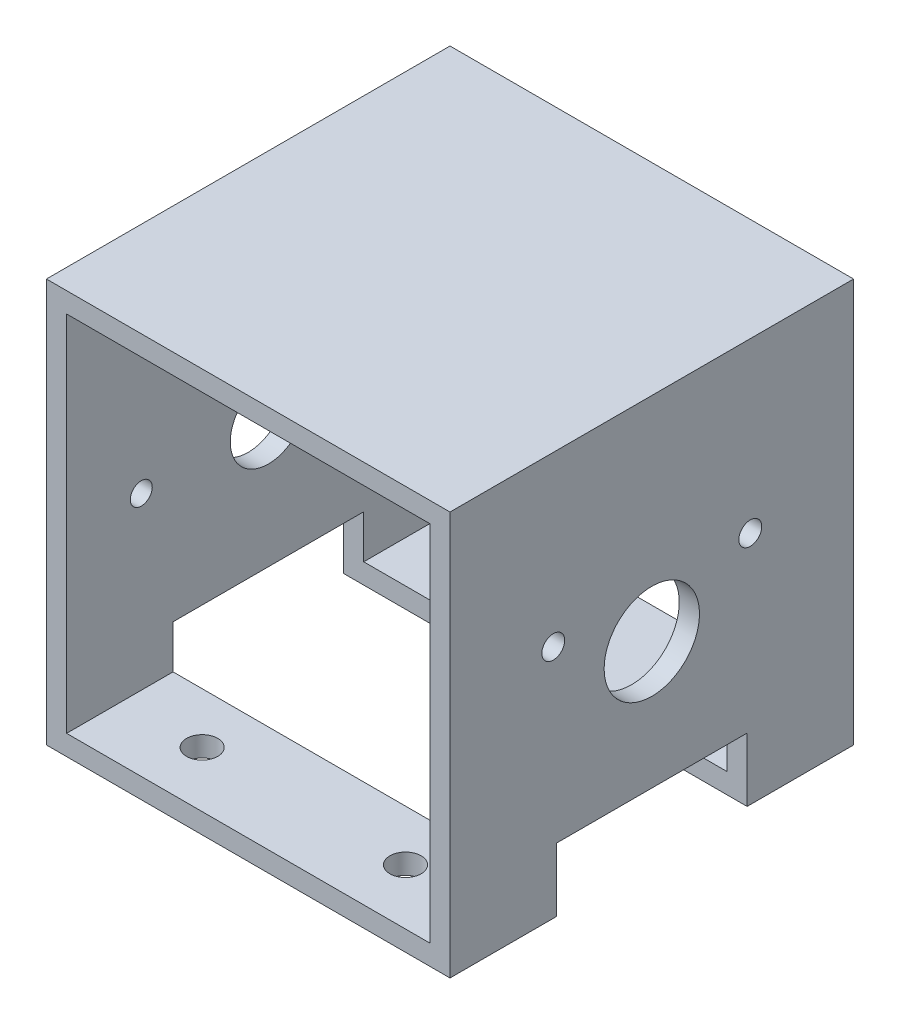
ISO-10303-21;
HEADER;
FILE_DESCRIPTION(('STEP AP214'),'2;1');
FILE_NAME('part.step','',(''),(''),'','','');
FILE_SCHEMA(('AUTOMOTIVE_DESIGN { 1 0 10303 214 1 1 1 1 }'));
ENDSEC;
DATA;
#1=APPLICATION_CONTEXT('core data for automotive mechanical design processes');
#2=APPLICATION_PROTOCOL_DEFINITION('international standard','automotive_design',2000,#1);
#3=PRODUCT_CONTEXT('',#1,'mechanical');
#4=PRODUCT('Part','Part','',(#3));
#5=PRODUCT_RELATED_PRODUCT_CATEGORY('part','',(#4));
#6=PRODUCT_DEFINITION_FORMATION('','',#4);
#7=PRODUCT_DEFINITION_CONTEXT('part definition',#1,'design');
#8=PRODUCT_DEFINITION('design','',#6,#7);
#9=PRODUCT_DEFINITION_SHAPE('','',#8);
#10=(LENGTH_UNIT() NAMED_UNIT(*) SI_UNIT(.MILLI.,.METRE.));
#11=(NAMED_UNIT(*) PLANE_ANGLE_UNIT() SI_UNIT($,.RADIAN.));
#12=(NAMED_UNIT(*) SI_UNIT($,.STERADIAN.) SOLID_ANGLE_UNIT());
#13=UNCERTAINTY_MEASURE_WITH_UNIT(LENGTH_MEASURE(1.E-05),#10,'distance_accuracy_value','');
#14=(GEOMETRIC_REPRESENTATION_CONTEXT(3) GLOBAL_UNCERTAINTY_ASSIGNED_CONTEXT((#13)) GLOBAL_UNIT_ASSIGNED_CONTEXT((#10,
#11,#12)) REPRESENTATION_CONTEXT('',''));
#15=CARTESIAN_POINT('',(0.,0.,0.));
#16=DIRECTION('',(0.,0.,1.));
#17=DIRECTION('',(1.,0.,0.));
#18=AXIS2_PLACEMENT_3D('',#15,#16,#17);
#19=CARTESIAN_POINT('',(-31.75,-31.75,63.5));
#20=DIRECTION('',(0.,1.,0.));
#21=DIRECTION('',(0.,0.,1.));
#22=AXIS2_PLACEMENT_3D('',#19,#20,#21);
#23=PLANE('',#22);
#24=CARTESIAN_POINT('',(-16.,-31.75,8.75000000000001));
#25=DIRECTION('',(0.,-1.,0.));
#26=DIRECTION('',(0.,0.,-1.));
#27=AXIS2_PLACEMENT_3D('',#24,#25,#26);
#28=CIRCLE('',#27,2.45745);
#29=CARTESIAN_POINT('',(-16.,-31.75,6.29255000000001));
#30=VERTEX_POINT('',#29);
#31=EDGE_CURVE('E464',#30,#30,#28,.T.);
#32=ORIENTED_EDGE('',*,*,#31,.F.);
#33=EDGE_LOOP('',(#32));
#34=FACE_BOUND('',#33,.T.);
#35=DIRECTION('',(0.,0.,-1.));
#36=VECTOR('',#35,1.);
#37=CARTESIAN_POINT('',(31.75,-31.75,63.5));
#38=LINE('',#37,#36);
#39=CARTESIAN_POINT('',(31.75,-31.75,16.75));
#40=VERTEX_POINT('',#39);
#41=CARTESIAN_POINT('',(31.75,-31.75,0.));
#42=VERTEX_POINT('',#41);
#43=EDGE_CURVE('E269',#40,#42,#38,.T.);
#44=ORIENTED_EDGE('',*,*,#43,.F.);
#45=DIRECTION('',(-1.,0.,0.));
#46=VECTOR('',#45,1.);
#47=CARTESIAN_POINT('',(-31.75,-31.75,16.75));
#48=LINE('',#47,#46);
#49=CARTESIAN_POINT('',(-31.75,-31.75,16.75));
#50=VERTEX_POINT('',#49);
#51=EDGE_CURVE('E220',#40,#50,#48,.T.);
#52=ORIENTED_EDGE('',*,*,#51,.T.);
#53=DIRECTION('',(0.,0.,-1.));
#54=VECTOR('',#53,1.);
#55=CARTESIAN_POINT('',(-31.75,-31.75,63.5));
#56=LINE('',#55,#54);
#57=CARTESIAN_POINT('',(-31.75,-31.75,0.));
#58=VERTEX_POINT('',#57);
#59=EDGE_CURVE('E196',#50,#58,#56,.T.);
#60=ORIENTED_EDGE('',*,*,#59,.T.);
#61=DIRECTION('',(1.,0.,0.));
#62=VECTOR('',#61,1.);
#63=CARTESIAN_POINT('',(-31.75,-31.75,0.));
#64=LINE('',#63,#62);
#65=EDGE_CURVE('E263',#58,#42,#64,.T.);
#66=ORIENTED_EDGE('',*,*,#65,.T.);
#67=EDGE_LOOP('',(#44,#52,#60,#66));
#68=FACE_BOUND('',#67,.T.);
#69=CARTESIAN_POINT('',(16.,-31.75,8.75000000000003));
#70=DIRECTION('',(0.,-1.,0.));
#71=DIRECTION('',(0.,0.,-1.));
#72=AXIS2_PLACEMENT_3D('',#69,#70,#71);
#73=CIRCLE('',#72,2.45745);
#74=CARTESIAN_POINT('',(16.,-31.75,6.29255000000003));
#75=VERTEX_POINT('',#74);
#76=EDGE_CURVE('E458',#75,#75,#73,.T.);
#77=ORIENTED_EDGE('',*,*,#76,.F.);
#78=EDGE_LOOP('',(#77));
#79=FACE_BOUND('',#78,.T.);
#80=ADVANCED_FACE('F58',(#34,#68,#79),#23,.F.);
#81=CARTESIAN_POINT('',(-31.75,-31.75,63.5));
#82=DIRECTION('',(1.,0.,0.));
#83=DIRECTION('',(0.,0.,-1.));
#84=AXIS2_PLACEMENT_3D('',#81,#82,#83);
#85=PLANE('',#84);
#86=CARTESIAN_POINT('',(-31.75,-1.75000000000001,31.75));
#87=DIRECTION('',(-1.,0.,0.));
#88=DIRECTION('',(0.,0.,1.));
#89=AXIS2_PLACEMENT_3D('',#86,#87,#88);
#90=CIRCLE('',#89,6.);
#91=CARTESIAN_POINT('',(-31.75,-1.75000000000001,37.75));
#92=VERTEX_POINT('',#91);
#93=EDGE_CURVE('E392',#92,#92,#90,.T.);
#94=ORIENTED_EDGE('',*,*,#93,.F.);
#95=EDGE_LOOP('',(#94));
#96=FACE_BOUND('',#95,.T.);
#97=CARTESIAN_POINT('',(-31.75,-1.75000000000001,11.75));
#98=DIRECTION('',(-1.,0.,0.));
#99=DIRECTION('',(0.,0.,1.));
#100=AXIS2_PLACEMENT_3D('',#97,#98,#99);
#101=CIRCLE('',#100,1.7272);
#102=CARTESIAN_POINT('',(-31.75,-1.75000000000001,13.4772));
#103=VERTEX_POINT('',#102);
#104=EDGE_CURVE('E403',#103,#103,#101,.T.);
#105=ORIENTED_EDGE('',*,*,#104,.F.);
#106=EDGE_LOOP('',(#105));
#107=FACE_BOUND('',#106,.T.);
#108=ORIENTED_EDGE('',*,*,#59,.F.);
#109=DIRECTION('',(0.,1.,0.));
#110=VECTOR('',#109,1.);
#111=CARTESIAN_POINT('',(-31.75,-41.75,16.75));
#112=LINE('',#111,#110);
#113=CARTESIAN_POINT('',(-31.75,-21.75,16.75));
#114=VERTEX_POINT('',#113);
#115=EDGE_CURVE('E174',#50,#114,#112,.T.);
#116=ORIENTED_EDGE('',*,*,#115,.T.);
#117=DIRECTION('',(0.,0.,1.));
#118=VECTOR('',#117,1.);
#119=CARTESIAN_POINT('',(-31.75,-21.75,16.75));
#120=LINE('',#119,#118);
#121=CARTESIAN_POINT('',(-31.75,-21.75,46.75));
#122=VERTEX_POINT('',#121);
#123=EDGE_CURVE('E185',#114,#122,#120,.T.);
#124=ORIENTED_EDGE('',*,*,#123,.T.);
#125=DIRECTION('',(0.,1.,0.));
#126=VECTOR('',#125,1.);
#127=CARTESIAN_POINT('',(-31.75,-41.75,46.75));
#128=LINE('',#127,#126);
#129=CARTESIAN_POINT('',(-31.75,-31.75,46.75));
#130=VERTEX_POINT('',#129);
#131=EDGE_CURVE('E190',#130,#122,#128,.T.);
#132=ORIENTED_EDGE('',*,*,#131,.F.);
#133=CARTESIAN_POINT('',(-31.75,-31.75,63.5));
#134=VERTEX_POINT('',#133);
#135=EDGE_CURVE('E281',#134,#130,#56,.T.);
#136=ORIENTED_EDGE('',*,*,#135,.F.);
#137=DIRECTION('',(0.,-1.,0.));
#138=VECTOR('',#137,1.);
#139=CARTESIAN_POINT('',(-31.75,-31.75,63.5));
#140=LINE('',#139,#138);
#141=CARTESIAN_POINT('',(-31.75,31.75,63.5));
#142=VERTEX_POINT('',#141);
#143=EDGE_CURVE('E265',#142,#134,#140,.T.);
#144=ORIENTED_EDGE('',*,*,#143,.F.);
#145=DIRECTION('',(0.,0.,-1.));
#146=VECTOR('',#145,1.);
#147=CARTESIAN_POINT('',(-31.75,31.75,63.5));
#148=LINE('',#147,#146);
#149=CARTESIAN_POINT('',(-31.75,31.75,0.));
#150=VERTEX_POINT('',#149);
#151=EDGE_CURVE('E284',#142,#150,#148,.T.);
#152=ORIENTED_EDGE('',*,*,#151,.T.);
#153=DIRECTION('',(0.,-1.,0.));
#154=VECTOR('',#153,1.);
#155=CARTESIAN_POINT('',(-31.75,-31.75,0.));
#156=LINE('',#155,#154);
#157=EDGE_CURVE('E274',#150,#58,#156,.T.);
#158=ORIENTED_EDGE('',*,*,#157,.T.);
#159=EDGE_LOOP('',(#108,#116,#124,#132,#136,#144,#152,#158));
#160=FACE_BOUND('',#159,.T.);
#161=CARTESIAN_POINT('',(-31.75,-1.75,51.75));
#162=DIRECTION('',(-1.,0.,0.));
#163=DIRECTION('',(0.,0.,1.));
#164=AXIS2_PLACEMENT_3D('',#161,#162,#163);
#165=CIRCLE('',#164,1.7272);
#166=CARTESIAN_POINT('',(-31.75,-1.75,53.4772));
#167=VERTEX_POINT('',#166);
#168=EDGE_CURVE('E395',#167,#167,#165,.T.);
#169=ORIENTED_EDGE('',*,*,#168,.F.);
#170=EDGE_LOOP('',(#169));
#171=FACE_BOUND('',#170,.T.);
#172=ADVANCED_FACE('F193',(#96,#107,#160,#171),#85,.F.);
#173=CARTESIAN_POINT('',(16.,-31.75,54.75));
#174=DIRECTION('',(0.,-1.,0.));
#175=DIRECTION('',(0.,0.,-1.));
#176=AXIS2_PLACEMENT_3D('',#173,#174,#175);
#177=CIRCLE('',#176,2.45745);
#178=CARTESIAN_POINT('',(16.,-31.75,52.29255));
#179=VERTEX_POINT('',#178);
#180=EDGE_CURVE('E377',#179,#179,#177,.T.);
#181=ORIENTED_EDGE('',*,*,#180,.F.);
#182=EDGE_LOOP('',(#181));
#183=FACE_BOUND('',#182,.T.);
#184=CARTESIAN_POINT('',(-16.,-31.75,54.75));
#185=DIRECTION('',(0.,-1.,0.));
#186=DIRECTION('',(0.,0.,-1.));
#187=AXIS2_PLACEMENT_3D('',#184,#185,#186);
#188=CIRCLE('',#187,2.45745);
#189=CARTESIAN_POINT('',(-16.,-31.75,52.29255));
#190=VERTEX_POINT('',#189);
#191=EDGE_CURVE('E380',#190,#190,#188,.T.);
#192=ORIENTED_EDGE('',*,*,#191,.F.);
#193=EDGE_LOOP('',(#192));
#194=FACE_BOUND('',#193,.T.);
#195=DIRECTION('',(-1.,0.,0.));
#196=VECTOR('',#195,1.);
#197=CARTESIAN_POINT('',(-31.75,-31.75,46.75));
#198=LINE('',#197,#196);
#199=CARTESIAN_POINT('',(31.75,-31.75,46.75));
#200=VERTEX_POINT('',#199);
#201=EDGE_CURVE('E215',#200,#130,#198,.T.);
#202=ORIENTED_EDGE('',*,*,#201,.F.);
#203=CARTESIAN_POINT('',(31.75,-31.75,63.5));
#204=VERTEX_POINT('',#203);
#205=EDGE_CURVE('E278',#204,#200,#38,.T.);
#206=ORIENTED_EDGE('',*,*,#205,.F.);
#207=DIRECTION('',(1.,0.,0.));
#208=VECTOR('',#207,1.);
#209=CARTESIAN_POINT('',(-31.75,-31.75,63.5));
#210=LINE('',#209,#208);
#211=EDGE_CURVE('E267',#134,#204,#210,.T.);
#212=ORIENTED_EDGE('',*,*,#211,.F.);
#213=ORIENTED_EDGE('',*,*,#135,.T.);
#214=EDGE_LOOP('',(#202,#206,#212,#213));
#215=FACE_BOUND('',#214,.T.);
#216=ADVANCED_FACE('F332',(#183,#194,#215),#23,.F.);
#217=CARTESIAN_POINT('',(0.,-28.575,63.5));
#218=DIRECTION('',(0.,1.,0.));
#219=DIRECTION('',(0.,0.,1.));
#220=AXIS2_PLACEMENT_3D('',#217,#218,#219);
#221=PLANE('',#220);
#222=CARTESIAN_POINT('',(16.,-28.575,54.75));
#223=DIRECTION('',(0.,1.,0.));
#224=DIRECTION('',(0.,0.,1.));
#225=AXIS2_PLACEMENT_3D('',#222,#223,#224);
#226=CIRCLE('',#225,2.45745);
#227=CARTESIAN_POINT('',(16.,-28.575,57.20745));
#228=VERTEX_POINT('',#227);
#229=EDGE_CURVE('E383',#228,#228,#226,.T.);
#230=ORIENTED_EDGE('',*,*,#229,.F.);
#231=EDGE_LOOP('',(#230));
#232=FACE_BOUND('',#231,.T.);
#233=CARTESIAN_POINT('',(-16.,-28.575,54.75));
#234=DIRECTION('',(0.,1.,0.));
#235=DIRECTION('',(0.,0.,1.));
#236=AXIS2_PLACEMENT_3D('',#233,#234,#235);
#237=CIRCLE('',#236,2.45745);
#238=CARTESIAN_POINT('',(-16.,-28.575,57.20745));
#239=VERTEX_POINT('',#238);
#240=EDGE_CURVE('E382',#239,#239,#237,.T.);
#241=ORIENTED_EDGE('',*,*,#240,.F.);
#242=EDGE_LOOP('',(#241));
#243=FACE_BOUND('',#242,.T.);
#244=DIRECTION('',(0.,0.,-1.));
#245=VECTOR('',#244,1.);
#246=CARTESIAN_POINT('',(28.575,-28.575,63.5));
#247=LINE('',#246,#245);
#248=CARTESIAN_POINT('',(28.575,-28.575,63.5));
#249=VERTEX_POINT('',#248);
#250=CARTESIAN_POINT('',(28.575,-28.575,46.75));
#251=VERTEX_POINT('',#250);
#252=EDGE_CURVE('E246',#249,#251,#247,.T.);
#253=ORIENTED_EDGE('',*,*,#252,.T.);
#254=DIRECTION('',(-1.,0.,0.));
#255=VECTOR('',#254,1.);
#256=CARTESIAN_POINT('',(0.,-28.575,46.75));
#257=LINE('',#256,#255);
#258=CARTESIAN_POINT('',(-28.575,-28.575,46.75));
#259=VERTEX_POINT('',#258);
#260=EDGE_CURVE('E290',#251,#259,#257,.T.);
#261=ORIENTED_EDGE('',*,*,#260,.T.);
#262=DIRECTION('',(0.,0.,-1.));
#263=VECTOR('',#262,1.);
#264=CARTESIAN_POINT('',(-28.575,-28.575,63.5));
#265=LINE('',#264,#263);
#266=CARTESIAN_POINT('',(-28.575,-28.575,63.5));
#267=VERTEX_POINT('',#266);
#268=EDGE_CURVE('E250',#267,#259,#265,.T.);
#269=ORIENTED_EDGE('',*,*,#268,.F.);
#270=DIRECTION('',(1.,0.,0.));
#271=VECTOR('',#270,1.);
#272=CARTESIAN_POINT('',(0.,-28.575,63.5));
#273=LINE('',#272,#271);
#274=EDGE_CURVE('E233',#267,#249,#273,.T.);
#275=ORIENTED_EDGE('',*,*,#274,.T.);
#276=EDGE_LOOP('',(#253,#261,#269,#275));
#277=FACE_BOUND('',#276,.T.);
#278=ADVANCED_FACE('F315',(#232,#243,#277),#221,.T.);
#279=CARTESIAN_POINT('',(0.,0.,63.5));
#280=DIRECTION('',(0.,0.,1.));
#281=DIRECTION('',(1.,0.,0.));
#282=AXIS2_PLACEMENT_3D('',#279,#280,#281);
#283=PLANE('',#282);
#284=DIRECTION('',(0.,1.,0.));
#285=VECTOR('',#284,1.);
#286=CARTESIAN_POINT('',(31.75,-31.75,63.5));
#287=LINE('',#286,#285);
#288=CARTESIAN_POINT('',(31.75,31.75,63.5));
#289=VERTEX_POINT('',#288);
#290=EDGE_CURVE('E259',#204,#289,#287,.T.);
#291=ORIENTED_EDGE('',*,*,#290,.T.);
#292=DIRECTION('',(-1.,0.,0.));
#293=VECTOR('',#292,1.);
#294=CARTESIAN_POINT('',(-31.75,31.75,63.5));
#295=LINE('',#294,#293);
#296=EDGE_CURVE('E262',#289,#142,#295,.T.);
#297=ORIENTED_EDGE('',*,*,#296,.T.);
#298=ORIENTED_EDGE('',*,*,#143,.T.);
#299=ORIENTED_EDGE('',*,*,#211,.T.);
#300=EDGE_LOOP('',(#291,#297,#298,#299));
#301=FACE_BOUND('',#300,.T.);
#302=DIRECTION('',(-1.,0.,0.));
#303=VECTOR('',#302,1.);
#304=CARTESIAN_POINT('',(0.,28.575,63.5));
#305=LINE('',#304,#303);
#306=CARTESIAN_POINT('',(28.575,28.575,63.5));
#307=VERTEX_POINT('',#306);
#308=CARTESIAN_POINT('',(-28.575,28.575,63.5));
#309=VERTEX_POINT('',#308);
#310=EDGE_CURVE('E227',#307,#309,#305,.T.);
#311=ORIENTED_EDGE('',*,*,#310,.F.);
#312=DIRECTION('',(0.,1.,0.));
#313=VECTOR('',#312,1.);
#314=CARTESIAN_POINT('',(28.575,0.,63.5));
#315=LINE('',#314,#313);
#316=EDGE_CURVE('E225',#249,#307,#315,.T.);
#317=ORIENTED_EDGE('',*,*,#316,.F.);
#318=ORIENTED_EDGE('',*,*,#274,.F.);
#319=DIRECTION('',(0.,-1.,0.));
#320=VECTOR('',#319,1.);
#321=CARTESIAN_POINT('',(-28.575,0.,63.5));
#322=LINE('',#321,#320);
#323=EDGE_CURVE('E230',#309,#267,#322,.T.);
#324=ORIENTED_EDGE('',*,*,#323,.F.);
#325=EDGE_LOOP('',(#311,#317,#318,#324));
#326=FACE_BOUND('',#325,.T.);
#327=ADVANCED_FACE('F311',(#301,#326),#283,.T.);
#328=CARTESIAN_POINT('',(0.,0.,0.));
#329=DIRECTION('',(0.,0.,1.));
#330=DIRECTION('',(1.,0.,0.));
#331=AXIS2_PLACEMENT_3D('',#328,#329,#330);
#332=PLANE('',#331);
#333=DIRECTION('',(0.,1.,0.));
#334=VECTOR('',#333,1.);
#335=CARTESIAN_POINT('',(31.75,-31.75,0.));
#336=LINE('',#335,#334);
#337=CARTESIAN_POINT('',(31.75,31.75,0.));
#338=VERTEX_POINT('',#337);
#339=EDGE_CURVE('E258',#42,#338,#336,.T.);
#340=ORIENTED_EDGE('',*,*,#339,.F.);
#341=ORIENTED_EDGE('',*,*,#65,.F.);
#342=ORIENTED_EDGE('',*,*,#157,.F.);
#343=DIRECTION('',(-1.,0.,0.));
#344=VECTOR('',#343,1.);
#345=CARTESIAN_POINT('',(-31.75,31.75,0.));
#346=LINE('',#345,#344);
#347=EDGE_CURVE('E272',#338,#150,#346,.T.);
#348=ORIENTED_EDGE('',*,*,#347,.F.);
#349=EDGE_LOOP('',(#340,#341,#342,#348));
#350=FACE_BOUND('',#349,.T.);
#351=DIRECTION('',(0.,1.,0.));
#352=VECTOR('',#351,1.);
#353=CARTESIAN_POINT('',(28.575,0.,0.));
#354=LINE('',#353,#352);
#355=CARTESIAN_POINT('',(28.575,-28.575,0.));
#356=VERTEX_POINT('',#355);
#357=CARTESIAN_POINT('',(28.575,28.575,0.));
#358=VERTEX_POINT('',#357);
#359=EDGE_CURVE('E224',#356,#358,#354,.T.);
#360=ORIENTED_EDGE('',*,*,#359,.T.);
#361=DIRECTION('',(-1.,0.,0.));
#362=VECTOR('',#361,1.);
#363=CARTESIAN_POINT('',(0.,28.575,0.));
#364=LINE('',#363,#362);
#365=CARTESIAN_POINT('',(-28.575,28.575,0.));
#366=VERTEX_POINT('',#365);
#367=EDGE_CURVE('E238',#358,#366,#364,.T.);
#368=ORIENTED_EDGE('',*,*,#367,.T.);
#369=DIRECTION('',(0.,-1.,0.));
#370=VECTOR('',#369,1.);
#371=CARTESIAN_POINT('',(-28.575,0.,0.));
#372=LINE('',#371,#370);
#373=CARTESIAN_POINT('',(-28.575,-28.575,0.));
#374=VERTEX_POINT('',#373);
#375=EDGE_CURVE('E241',#366,#374,#372,.T.);
#376=ORIENTED_EDGE('',*,*,#375,.T.);
#377=DIRECTION('',(1.,0.,0.));
#378=VECTOR('',#377,1.);
#379=CARTESIAN_POINT('',(0.,-28.575,0.));
#380=LINE('',#379,#378);
#381=EDGE_CURVE('E228',#374,#356,#380,.T.);
#382=ORIENTED_EDGE('',*,*,#381,.T.);
#383=EDGE_LOOP('',(#360,#368,#376,#382));
#384=FACE_BOUND('',#383,.T.);
#385=ADVANCED_FACE('F304',(#350,#384),#332,.F.);
#386=CARTESIAN_POINT('',(31.75,-31.75,63.5));
#387=DIRECTION('',(-1.,0.,0.));
#388=DIRECTION('',(0.,0.,1.));
#389=AXIS2_PLACEMENT_3D('',#386,#387,#388);
#390=PLANE('',#389);
#391=CARTESIAN_POINT('',(31.75,5.25,16.25));
#392=DIRECTION('',(-1.,0.,0.));
#393=DIRECTION('',(0.,0.,1.));
#394=AXIS2_PLACEMENT_3D('',#391,#392,#393);
#395=CIRCLE('',#394,1.8);
#396=CARTESIAN_POINT('',(31.75,5.25,18.05));
#397=VERTEX_POINT('',#396);
#398=EDGE_CURVE('E412',#397,#397,#395,.T.);
#399=ORIENTED_EDGE('',*,*,#398,.T.);
#400=EDGE_LOOP('',(#399));
#401=FACE_BOUND('',#400,.T.);
#402=CARTESIAN_POINT('',(31.75,5.25,47.25));
#403=DIRECTION('',(-1.,0.,0.));
#404=DIRECTION('',(0.,0.,1.));
#405=AXIS2_PLACEMENT_3D('',#402,#403,#404);
#406=CIRCLE('',#405,1.8);
#407=CARTESIAN_POINT('',(31.75,5.25,49.05));
#408=VERTEX_POINT('',#407);
#409=EDGE_CURVE('E418',#408,#408,#406,.T.);
#410=ORIENTED_EDGE('',*,*,#409,.T.);
#411=EDGE_LOOP('',(#410));
#412=FACE_BOUND('',#411,.T.);
#413=CARTESIAN_POINT('',(31.75,-1.75000000000001,31.75));
#414=DIRECTION('',(-1.,0.,0.));
#415=DIRECTION('',(0.,0.,1.));
#416=AXIS2_PLACEMENT_3D('',#413,#414,#415);
#417=CIRCLE('',#416,7.5);
#418=CARTESIAN_POINT('',(31.75,-1.75000000000001,39.25));
#419=VERTEX_POINT('',#418);
#420=EDGE_CURVE('E207',#419,#419,#417,.T.);
#421=ORIENTED_EDGE('',*,*,#420,.T.);
#422=EDGE_LOOP('',(#421));
#423=FACE_BOUND('',#422,.T.);
#424=DIRECTION('',(0.,0.,1.));
#425=VECTOR('',#424,1.);
#426=CARTESIAN_POINT('',(31.75,-21.75,16.75));
#427=LINE('',#426,#425);
#428=CARTESIAN_POINT('',(31.75,-21.75,16.75));
#429=VERTEX_POINT('',#428);
#430=CARTESIAN_POINT('',(31.75,-21.75,46.75));
#431=VERTEX_POINT('',#430);
#432=EDGE_CURVE('E198',#429,#431,#427,.T.);
#433=ORIENTED_EDGE('',*,*,#432,.F.);
#434=DIRECTION('',(0.,1.,0.));
#435=VECTOR('',#434,1.);
#436=CARTESIAN_POINT('',(31.75,-41.75,16.75));
#437=LINE('',#436,#435);
#438=EDGE_CURVE('E205',#40,#429,#437,.T.);
#439=ORIENTED_EDGE('',*,*,#438,.F.);
#440=ORIENTED_EDGE('',*,*,#43,.T.);
#441=ORIENTED_EDGE('',*,*,#339,.T.);
#442=DIRECTION('',(0.,0.,-1.));
#443=VECTOR('',#442,1.);
#444=CARTESIAN_POINT('',(31.75,31.75,63.5));
#445=LINE('',#444,#443);
#446=EDGE_CURVE('E287',#289,#338,#445,.T.);
#447=ORIENTED_EDGE('',*,*,#446,.F.);
#448=ORIENTED_EDGE('',*,*,#290,.F.);
#449=ORIENTED_EDGE('',*,*,#205,.T.);
#450=DIRECTION('',(0.,1.,0.));
#451=VECTOR('',#450,1.);
#452=CARTESIAN_POINT('',(31.75,-41.75,46.75));
#453=LINE('',#452,#451);
#454=EDGE_CURVE('E73',#200,#431,#453,.T.);
#455=ORIENTED_EDGE('',*,*,#454,.T.);
#456=EDGE_LOOP('',(#433,#439,#440,#441,#447,#448,#449,#455));
#457=FACE_BOUND('',#456,.T.);
#458=ADVANCED_FACE('F60',(#401,#412,#423,#457),#390,.F.);
#459=CARTESIAN_POINT('',(-31.75,31.75,63.5));
#460=DIRECTION('',(0.,-1.,0.));
#461=DIRECTION('',(0.,0.,-1.));
#462=AXIS2_PLACEMENT_3D('',#459,#460,#461);
#463=PLANE('',#462);
#464=ORIENTED_EDGE('',*,*,#347,.T.);
#465=ORIENTED_EDGE('',*,*,#151,.F.);
#466=ORIENTED_EDGE('',*,*,#296,.F.);
#467=ORIENTED_EDGE('',*,*,#446,.T.);
#468=EDGE_LOOP('',(#464,#465,#466,#467));
#469=FACE_BOUND('',#468,.T.);
#470=ADVANCED_FACE('F339',(#469),#463,.F.);
#471=CARTESIAN_POINT('',(28.575,0.,63.5));
#472=DIRECTION('',(-1.,0.,0.));
#473=DIRECTION('',(0.,0.,1.));
#474=AXIS2_PLACEMENT_3D('',#471,#472,#473);
#475=PLANE('',#474);
#476=CARTESIAN_POINT('',(28.575,5.25,16.25));
#477=DIRECTION('',(-1.,0.,0.));
#478=DIRECTION('',(0.,0.,1.));
#479=AXIS2_PLACEMENT_3D('',#476,#477,#478);
#480=CIRCLE('',#479,1.8);
#481=CARTESIAN_POINT('',(28.575,5.25,18.05));
#482=VERTEX_POINT('',#481);
#483=EDGE_CURVE('E409',#482,#482,#480,.T.);
#484=ORIENTED_EDGE('',*,*,#483,.F.);
#485=EDGE_LOOP('',(#484));
#486=FACE_BOUND('',#485,.T.);
#487=CARTESIAN_POINT('',(28.575,5.25,47.25));
#488=DIRECTION('',(-1.,0.,0.));
#489=DIRECTION('',(0.,0.,1.));
#490=AXIS2_PLACEMENT_3D('',#487,#488,#489);
#491=CIRCLE('',#490,1.8);
#492=CARTESIAN_POINT('',(28.575,5.25,49.05));
#493=VERTEX_POINT('',#492);
#494=EDGE_CURVE('E415',#493,#493,#491,.T.);
#495=ORIENTED_EDGE('',*,*,#494,.F.);
#496=EDGE_LOOP('',(#495));
#497=FACE_BOUND('',#496,.T.);
#498=CARTESIAN_POINT('',(28.575,-1.75000000000001,31.75));
#499=DIRECTION('',(-1.,0.,0.));
#500=DIRECTION('',(0.,0.,1.));
#501=AXIS2_PLACEMENT_3D('',#498,#499,#500);
#502=CIRCLE('',#501,7.5);
#503=CARTESIAN_POINT('',(28.575,-1.75000000000001,39.25));
#504=VERTEX_POINT('',#503);
#505=EDGE_CURVE('E201',#504,#504,#502,.T.);
#506=ORIENTED_EDGE('',*,*,#505,.F.);
#507=EDGE_LOOP('',(#506));
#508=FACE_BOUND('',#507,.T.);
#509=DIRECTION('',(0.,-1.,0.));
#510=VECTOR('',#509,1.);
#511=CARTESIAN_POINT('',(28.575,0.,16.75));
#512=LINE('',#511,#510);
#513=CARTESIAN_POINT('',(28.575,-21.75,16.75));
#514=VERTEX_POINT('',#513);
#515=CARTESIAN_POINT('',(28.575,-28.575,16.75));
#516=VERTEX_POINT('',#515);
#517=EDGE_CURVE('E218',#514,#516,#512,.T.);
#518=ORIENTED_EDGE('',*,*,#517,.F.);
#519=DIRECTION('',(0.,0.,-1.));
#520=VECTOR('',#519,1.);
#521=CARTESIAN_POINT('',(28.575,-21.75,63.5));
#522=LINE('',#521,#520);
#523=CARTESIAN_POINT('',(28.575,-21.75,46.75));
#524=VERTEX_POINT('',#523);
#525=EDGE_CURVE('E222',#524,#514,#522,.T.);
#526=ORIENTED_EDGE('',*,*,#525,.F.);
#527=DIRECTION('',(0.,-1.,0.));
#528=VECTOR('',#527,1.);
#529=CARTESIAN_POINT('',(28.575,0.,46.75));
#530=LINE('',#529,#528);
#531=EDGE_CURVE('E212',#524,#251,#530,.T.);
#532=ORIENTED_EDGE('',*,*,#531,.T.);
#533=ORIENTED_EDGE('',*,*,#252,.F.);
#534=ORIENTED_EDGE('',*,*,#316,.T.);
#535=DIRECTION('',(0.,0.,-1.));
#536=VECTOR('',#535,1.);
#537=CARTESIAN_POINT('',(28.575,28.575,63.5));
#538=LINE('',#537,#536);
#539=EDGE_CURVE('E255',#307,#358,#538,.T.);
#540=ORIENTED_EDGE('',*,*,#539,.T.);
#541=ORIENTED_EDGE('',*,*,#359,.F.);
#542=EDGE_CURVE('E235',#516,#356,#247,.T.);
#543=ORIENTED_EDGE('',*,*,#542,.F.);
#544=EDGE_LOOP('',(#518,#526,#532,#533,#534,#540,#541,#543));
#545=FACE_BOUND('',#544,.T.);
#546=ADVANCED_FACE('F317',(#486,#497,#508,#545),#475,.T.);
#547=CARTESIAN_POINT('',(0.,28.575,63.5));
#548=DIRECTION('',(0.,-1.,0.));
#549=DIRECTION('',(0.,0.,-1.));
#550=AXIS2_PLACEMENT_3D('',#547,#548,#549);
#551=PLANE('',#550);
#552=ORIENTED_EDGE('',*,*,#367,.F.);
#553=ORIENTED_EDGE('',*,*,#539,.F.);
#554=ORIENTED_EDGE('',*,*,#310,.T.);
#555=DIRECTION('',(0.,0.,-1.));
#556=VECTOR('',#555,1.);
#557=CARTESIAN_POINT('',(-28.575,28.575,63.5));
#558=LINE('',#557,#556);
#559=EDGE_CURVE('E253',#309,#366,#558,.T.);
#560=ORIENTED_EDGE('',*,*,#559,.T.);
#561=EDGE_LOOP('',(#552,#553,#554,#560));
#562=FACE_BOUND('',#561,.T.);
#563=ADVANCED_FACE('F346',(#562),#551,.T.);
#564=CARTESIAN_POINT('',(-28.575,0.,63.5));
#565=DIRECTION('',(1.,0.,0.));
#566=DIRECTION('',(0.,0.,-1.));
#567=AXIS2_PLACEMENT_3D('',#564,#565,#566);
#568=PLANE('',#567);
#569=CARTESIAN_POINT('',(-28.575,-1.75000000000001,31.75));
#570=DIRECTION('',(1.,0.,0.));
#571=DIRECTION('',(0.,0.,-1.));
#572=AXIS2_PLACEMENT_3D('',#569,#570,#571);
#573=CIRCLE('',#572,6.);
#574=CARTESIAN_POINT('',(-28.575,-1.75000000000001,25.75));
#575=VERTEX_POINT('',#574);
#576=EDGE_CURVE('E386',#575,#575,#573,.F.);
#577=ORIENTED_EDGE('',*,*,#576,.T.);
#578=EDGE_LOOP('',(#577));
#579=FACE_BOUND('',#578,.T.);
#580=CARTESIAN_POINT('',(-28.575,-1.75,51.75));
#581=DIRECTION('',(1.,0.,0.));
#582=DIRECTION('',(0.,0.,-1.));
#583=AXIS2_PLACEMENT_3D('',#580,#581,#582);
#584=CIRCLE('',#583,1.7272);
#585=CARTESIAN_POINT('',(-28.575,-1.75,50.0228));
#586=VERTEX_POINT('',#585);
#587=EDGE_CURVE('E400',#586,#586,#584,.T.);
#588=ORIENTED_EDGE('',*,*,#587,.F.);
#589=EDGE_LOOP('',(#588));
#590=FACE_BOUND('',#589,.T.);
#591=CARTESIAN_POINT('',(-28.575,-1.75000000000001,11.75));
#592=DIRECTION('',(1.,0.,0.));
#593=DIRECTION('',(0.,0.,-1.));
#594=AXIS2_PLACEMENT_3D('',#591,#592,#593);
#595=CIRCLE('',#594,1.7272);
#596=CARTESIAN_POINT('',(-28.575,-1.75000000000001,10.0228));
#597=VERTEX_POINT('',#596);
#598=EDGE_CURVE('E406',#597,#597,#595,.T.);
#599=ORIENTED_EDGE('',*,*,#598,.F.);
#600=EDGE_LOOP('',(#599));
#601=FACE_BOUND('',#600,.T.);
#602=DIRECTION('',(0.,1.,0.));
#603=VECTOR('',#602,1.);
#604=CARTESIAN_POINT('',(-28.575,0.,16.75));
#605=LINE('',#604,#603);
#606=CARTESIAN_POINT('',(-28.575,-28.575,16.75));
#607=VERTEX_POINT('',#606);
#608=CARTESIAN_POINT('',(-28.575,-21.75,16.75));
#609=VERTEX_POINT('',#608);
#610=EDGE_CURVE('E177',#607,#609,#605,.T.);
#611=ORIENTED_EDGE('',*,*,#610,.F.);
#612=EDGE_CURVE('E249',#607,#374,#265,.T.);
#613=ORIENTED_EDGE('',*,*,#612,.T.);
#614=ORIENTED_EDGE('',*,*,#375,.F.);
#615=ORIENTED_EDGE('',*,*,#559,.F.);
#616=ORIENTED_EDGE('',*,*,#323,.T.);
#617=ORIENTED_EDGE('',*,*,#268,.T.);
#618=DIRECTION('',(0.,1.,0.));
#619=VECTOR('',#618,1.);
#620=CARTESIAN_POINT('',(-28.575,0.,46.75));
#621=LINE('',#620,#619);
#622=CARTESIAN_POINT('',(-28.575,-21.75,46.75));
#623=VERTEX_POINT('',#622);
#624=EDGE_CURVE('E80',#259,#623,#621,.T.);
#625=ORIENTED_EDGE('',*,*,#624,.T.);
#626=DIRECTION('',(0.,0.,1.));
#627=VECTOR('',#626,1.);
#628=CARTESIAN_POINT('',(-28.575,-21.75,63.5));
#629=LINE('',#628,#627);
#630=EDGE_CURVE('E12',#609,#623,#629,.T.);
#631=ORIENTED_EDGE('',*,*,#630,.F.);
#632=EDGE_LOOP('',(#611,#613,#614,#615,#616,#617,#625,#631));
#633=FACE_BOUND('',#632,.T.);
#634=ADVANCED_FACE('F298',(#579,#590,#601,#633),#568,.T.);
#635=CARTESIAN_POINT('',(-16.,-28.575,8.75000000000001));
#636=DIRECTION('',(0.,1.,0.));
#637=DIRECTION('',(0.,0.,1.));
#638=AXIS2_PLACEMENT_3D('',#635,#636,#637);
#639=CIRCLE('',#638,2.45745);
#640=CARTESIAN_POINT('',(-16.,-28.575,11.20745));
#641=VERTEX_POINT('',#640);
#642=EDGE_CURVE('E453',#641,#641,#639,.T.);
#643=ORIENTED_EDGE('',*,*,#642,.F.);
#644=EDGE_LOOP('',(#643));
#645=FACE_BOUND('',#644,.T.);
#646=CARTESIAN_POINT('',(16.,-28.575,8.75000000000003));
#647=DIRECTION('',(0.,1.,0.));
#648=DIRECTION('',(0.,0.,1.));
#649=AXIS2_PLACEMENT_3D('',#646,#647,#648);
#650=CIRCLE('',#649,2.45745);
#651=CARTESIAN_POINT('',(16.,-28.575,11.20745));
#652=VERTEX_POINT('',#651);
#653=EDGE_CURVE('E456',#652,#652,#650,.T.);
#654=ORIENTED_EDGE('',*,*,#653,.F.);
#655=EDGE_LOOP('',(#654));
#656=FACE_BOUND('',#655,.T.);
#657=DIRECTION('',(-1.,0.,0.));
#658=VECTOR('',#657,1.);
#659=CARTESIAN_POINT('',(0.,-28.575,16.75));
#660=LINE('',#659,#658);
#661=EDGE_CURVE('E66',#516,#607,#660,.T.);
#662=ORIENTED_EDGE('',*,*,#661,.F.);
#663=ORIENTED_EDGE('',*,*,#542,.T.);
#664=ORIENTED_EDGE('',*,*,#381,.F.);
#665=ORIENTED_EDGE('',*,*,#612,.F.);
#666=EDGE_LOOP('',(#662,#663,#664,#665));
#667=FACE_BOUND('',#666,.T.);
#668=ADVANCED_FACE('F301',(#645,#656,#667),#221,.T.);
#669=CARTESIAN_POINT('',(-31.75,-21.75,16.75));
#670=DIRECTION('',(0.,1.,0.));
#671=DIRECTION('',(0.,0.,1.));
#672=AXIS2_PLACEMENT_3D('',#669,#670,#671);
#673=PLANE('',#672);
#674=ORIENTED_EDGE('',*,*,#525,.T.);
#675=DIRECTION('',(1.,0.,0.));
#676=VECTOR('',#675,1.);
#677=CARTESIAN_POINT('',(-31.75,-21.75,16.75));
#678=LINE('',#677,#676);
#679=EDGE_CURVE('E181',#514,#429,#678,.T.);
#680=ORIENTED_EDGE('',*,*,#679,.T.);
#681=ORIENTED_EDGE('',*,*,#432,.T.);
#682=DIRECTION('',(1.,0.,0.));
#683=VECTOR('',#682,1.);
#684=CARTESIAN_POINT('',(-31.75,-21.75,46.75));
#685=LINE('',#684,#683);
#686=EDGE_CURVE('E180',#524,#431,#685,.T.);
#687=ORIENTED_EDGE('',*,*,#686,.F.);
#688=EDGE_LOOP('',(#674,#680,#681,#687));
#689=FACE_BOUND('',#688,.T.);
#690=ADVANCED_FACE('F323',(#689),#673,.F.);
#691=CARTESIAN_POINT('',(-31.75,-41.75,16.75));
#692=DIRECTION('',(0.,0.,-1.));
#693=DIRECTION('',(-1.,0.,0.));
#694=AXIS2_PLACEMENT_3D('',#691,#692,#693);
#695=PLANE('',#694);
#696=ORIENTED_EDGE('',*,*,#438,.T.);
#697=ORIENTED_EDGE('',*,*,#679,.F.);
#698=ORIENTED_EDGE('',*,*,#517,.T.);
#699=ORIENTED_EDGE('',*,*,#661,.T.);
#700=ORIENTED_EDGE('',*,*,#610,.T.);
#701=EDGE_CURVE('E169',#114,#609,#678,.T.);
#702=ORIENTED_EDGE('',*,*,#701,.F.);
#703=ORIENTED_EDGE('',*,*,#115,.F.);
#704=ORIENTED_EDGE('',*,*,#51,.F.);
#705=EDGE_LOOP('',(#696,#697,#698,#699,#700,#702,#703,#704));
#706=FACE_BOUND('',#705,.T.);
#707=ADVANCED_FACE('F172',(#706),#695,.F.);
#708=CARTESIAN_POINT('',(-31.75,-41.75,46.75));
#709=DIRECTION('',(0.,0.,-1.));
#710=DIRECTION('',(-1.,0.,0.));
#711=AXIS2_PLACEMENT_3D('',#708,#709,#710);
#712=PLANE('',#711);
#713=ORIENTED_EDGE('',*,*,#201,.T.);
#714=ORIENTED_EDGE('',*,*,#131,.T.);
#715=EDGE_CURVE('E187',#122,#623,#685,.T.);
#716=ORIENTED_EDGE('',*,*,#715,.T.);
#717=ORIENTED_EDGE('',*,*,#624,.F.);
#718=ORIENTED_EDGE('',*,*,#260,.F.);
#719=ORIENTED_EDGE('',*,*,#531,.F.);
#720=ORIENTED_EDGE('',*,*,#686,.T.);
#721=ORIENTED_EDGE('',*,*,#454,.F.);
#722=EDGE_LOOP('',(#713,#714,#716,#717,#718,#719,#720,#721));
#723=FACE_BOUND('',#722,.T.);
#724=ADVANCED_FACE('F321',(#723),#712,.T.);
#725=ORIENTED_EDGE('',*,*,#630,.T.);
#726=ORIENTED_EDGE('',*,*,#715,.F.);
#727=ORIENTED_EDGE('',*,*,#123,.F.);
#728=ORIENTED_EDGE('',*,*,#701,.T.);
#729=EDGE_LOOP('',(#725,#726,#727,#728));
#730=FACE_BOUND('',#729,.T.);
#731=ADVANCED_FACE('F186',(#730),#673,.F.);
#732=CARTESIAN_POINT('',(31.75,-1.75000000000001,31.75));
#733=DIRECTION('',(-1.,0.,0.));
#734=DIRECTION('',(0.,0.,1.));
#735=AXIS2_PLACEMENT_3D('',#732,#733,#734);
#736=CYLINDRICAL_SURFACE('',#735,7.5);
#737=ORIENTED_EDGE('',*,*,#420,.F.);
#738=EDGE_LOOP('',(#737));
#739=FACE_BOUND('',#738,.T.);
#740=ORIENTED_EDGE('',*,*,#505,.T.);
#741=EDGE_LOOP('',(#740));
#742=FACE_BOUND('',#741,.T.);
#743=ADVANCED_FACE('F426',(#739,#742),#736,.F.);
#744=CARTESIAN_POINT('',(28.575,5.25,47.25));
#745=DIRECTION('',(-1.,0.,0.));
#746=DIRECTION('',(0.,0.,1.));
#747=AXIS2_PLACEMENT_3D('',#744,#745,#746);
#748=CYLINDRICAL_SURFACE('',#747,1.8);
#749=ORIENTED_EDGE('',*,*,#409,.F.);
#750=EDGE_LOOP('',(#749));
#751=FACE_BOUND('',#750,.T.);
#752=ORIENTED_EDGE('',*,*,#494,.T.);
#753=EDGE_LOOP('',(#752));
#754=FACE_BOUND('',#753,.T.);
#755=ADVANCED_FACE('F429',(#751,#754),#748,.F.);
#756=CARTESIAN_POINT('',(28.575,5.25,16.25));
#757=DIRECTION('',(-1.,0.,0.));
#758=DIRECTION('',(0.,0.,1.));
#759=AXIS2_PLACEMENT_3D('',#756,#757,#758);
#760=CYLINDRICAL_SURFACE('',#759,1.8);
#761=ORIENTED_EDGE('',*,*,#398,.F.);
#762=EDGE_LOOP('',(#761));
#763=FACE_BOUND('',#762,.T.);
#764=ORIENTED_EDGE('',*,*,#483,.T.);
#765=EDGE_LOOP('',(#764));
#766=FACE_BOUND('',#765,.T.);
#767=ADVANCED_FACE('F436',(#763,#766),#760,.F.);
#768=CARTESIAN_POINT('',(-31.75,-1.75000000000001,11.75));
#769=DIRECTION('',(-1.,0.,0.));
#770=DIRECTION('',(0.,0.,1.));
#771=AXIS2_PLACEMENT_3D('',#768,#769,#770);
#772=CYLINDRICAL_SURFACE('',#771,1.7272);
#773=ORIENTED_EDGE('',*,*,#104,.T.);
#774=EDGE_LOOP('',(#773));
#775=FACE_BOUND('',#774,.T.);
#776=ORIENTED_EDGE('',*,*,#598,.T.);
#777=EDGE_LOOP('',(#776));
#778=FACE_BOUND('',#777,.T.);
#779=ADVANCED_FACE('F492',(#775,#778),#772,.F.);
#780=CARTESIAN_POINT('',(-31.75,-1.75,51.75));
#781=DIRECTION('',(-1.,0.,0.));
#782=DIRECTION('',(0.,0.,1.));
#783=AXIS2_PLACEMENT_3D('',#780,#781,#782);
#784=CYLINDRICAL_SURFACE('',#783,1.7272);
#785=ORIENTED_EDGE('',*,*,#168,.T.);
#786=EDGE_LOOP('',(#785));
#787=FACE_BOUND('',#786,.T.);
#788=ORIENTED_EDGE('',*,*,#587,.T.);
#789=EDGE_LOOP('',(#788));
#790=FACE_BOUND('',#789,.T.);
#791=ADVANCED_FACE('F488',(#787,#790),#784,.F.);
#792=CARTESIAN_POINT('',(31.751,-1.75000000000001,31.75));
#793=DIRECTION('',(-1.,0.,0.));
#794=DIRECTION('',(0.,0.,1.));
#795=AXIS2_PLACEMENT_3D('',#792,#793,#794);
#796=CYLINDRICAL_SURFACE('',#795,6.);
#797=ORIENTED_EDGE('',*,*,#576,.F.);
#798=EDGE_LOOP('',(#797));
#799=FACE_BOUND('',#798,.T.);
#800=ORIENTED_EDGE('',*,*,#93,.T.);
#801=EDGE_LOOP('',(#800));
#802=FACE_BOUND('',#801,.T.);
#803=ADVANCED_FACE('F485',(#799,#802),#796,.F.);
#804=CARTESIAN_POINT('',(-16.,-31.75,54.75));
#805=DIRECTION('',(0.,-1.,0.));
#806=DIRECTION('',(0.,0.,-1.));
#807=AXIS2_PLACEMENT_3D('',#804,#805,#806);
#808=CYLINDRICAL_SURFACE('',#807,2.45745);
#809=ORIENTED_EDGE('',*,*,#191,.T.);
#810=EDGE_LOOP('',(#809));
#811=FACE_BOUND('',#810,.T.);
#812=ORIENTED_EDGE('',*,*,#240,.T.);
#813=EDGE_LOOP('',(#812));
#814=FACE_BOUND('',#813,.T.);
#815=ADVANCED_FACE('F481',(#811,#814),#808,.F.);
#816=CARTESIAN_POINT('',(16.,-31.75,54.75));
#817=DIRECTION('',(0.,-1.,0.));
#818=DIRECTION('',(0.,0.,-1.));
#819=AXIS2_PLACEMENT_3D('',#816,#817,#818);
#820=CYLINDRICAL_SURFACE('',#819,2.45745);
#821=ORIENTED_EDGE('',*,*,#180,.T.);
#822=EDGE_LOOP('',(#821));
#823=FACE_BOUND('',#822,.T.);
#824=ORIENTED_EDGE('',*,*,#229,.T.);
#825=EDGE_LOOP('',(#824));
#826=FACE_BOUND('',#825,.T.);
#827=ADVANCED_FACE('F475',(#823,#826),#820,.F.);
#828=CARTESIAN_POINT('',(16.,-31.75,8.75000000000003));
#829=DIRECTION('',(0.,-1.,0.));
#830=DIRECTION('',(0.,0.,-1.));
#831=AXIS2_PLACEMENT_3D('',#828,#829,#830);
#832=CYLINDRICAL_SURFACE('',#831,2.45745);
#833=ORIENTED_EDGE('',*,*,#76,.T.);
#834=EDGE_LOOP('',(#833));
#835=FACE_BOUND('',#834,.T.);
#836=ORIENTED_EDGE('',*,*,#653,.T.);
#837=EDGE_LOOP('',(#836));
#838=FACE_BOUND('',#837,.T.);
#839=ADVANCED_FACE('F470',(#835,#838),#832,.F.);
#840=CARTESIAN_POINT('',(-16.,-31.75,8.75000000000001));
#841=DIRECTION('',(0.,-1.,0.));
#842=DIRECTION('',(0.,0.,-1.));
#843=AXIS2_PLACEMENT_3D('',#840,#841,#842);
#844=CYLINDRICAL_SURFACE('',#843,2.45745);
#845=ORIENTED_EDGE('',*,*,#31,.T.);
#846=EDGE_LOOP('',(#845));
#847=FACE_BOUND('',#846,.T.);
#848=ORIENTED_EDGE('',*,*,#642,.T.);
#849=EDGE_LOOP('',(#848));
#850=FACE_BOUND('',#849,.T.);
#851=ADVANCED_FACE('F467',(#847,#850),#844,.F.);
#852=CLOSED_SHELL('',(#80,#172,#216,#278,#327,#385,#458,#470,#546,#563,#634,#668,#690,#707,#724,
#731,#743,#755,#767,#779,#791,#803,#815,#827,#839,#851));
#853=MANIFOLD_SOLID_BREP('B2',#852);
#854=ADVANCED_BREP_SHAPE_REPRESENTATION('',(#18,#853),#14);
#855=SHAPE_DEFINITION_REPRESENTATION(#9,#854);
ENDSEC;
END-ISO-10303-21;
